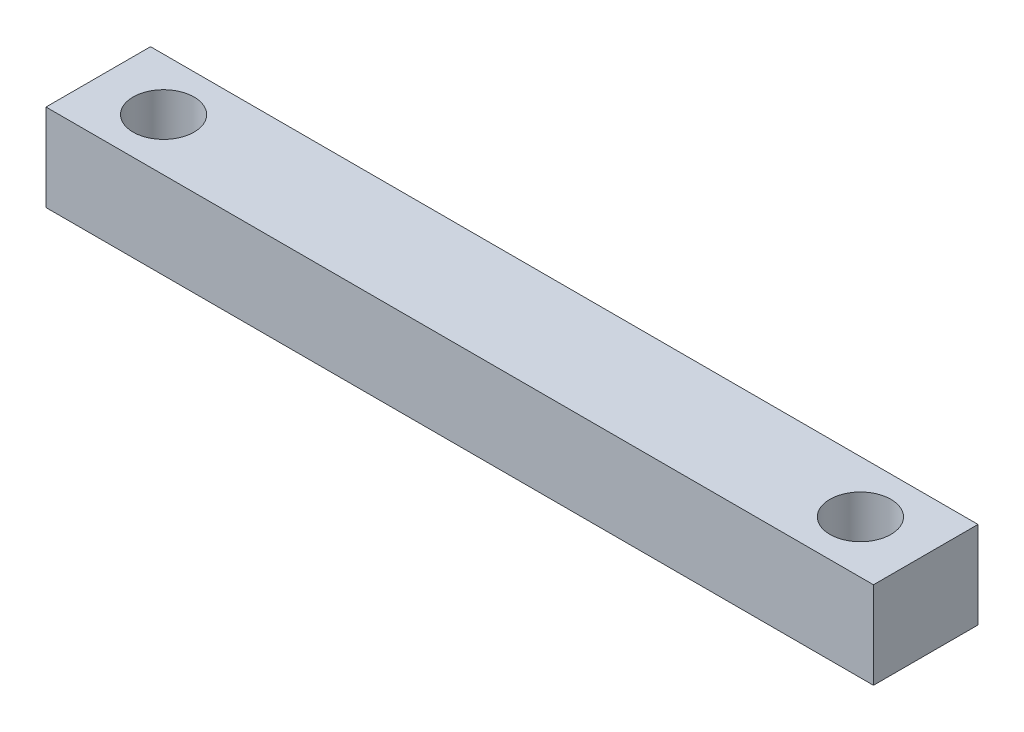
ISO-10303-21;
HEADER;
FILE_DESCRIPTION(('STEP AP214'),'2;1');
FILE_NAME('part.step','',(''),(''),'','','');
FILE_SCHEMA(('AUTOMOTIVE_DESIGN { 1 0 10303 214 1 1 1 1 }'));
ENDSEC;
DATA;
#1=APPLICATION_CONTEXT('core data for automotive mechanical design processes');
#2=APPLICATION_PROTOCOL_DEFINITION('international standard','automotive_design',2000,#1);
#3=PRODUCT_CONTEXT('',#1,'mechanical');
#4=PRODUCT('Part','Part','',(#3));
#5=PRODUCT_RELATED_PRODUCT_CATEGORY('part','',(#4));
#6=PRODUCT_DEFINITION_FORMATION('','',#4);
#7=PRODUCT_DEFINITION_CONTEXT('part definition',#1,'design');
#8=PRODUCT_DEFINITION('design','',#6,#7);
#9=PRODUCT_DEFINITION_SHAPE('','',#8);
#10=(LENGTH_UNIT() NAMED_UNIT(*) SI_UNIT(.MILLI.,.METRE.));
#11=(NAMED_UNIT(*) PLANE_ANGLE_UNIT() SI_UNIT($,.RADIAN.));
#12=(NAMED_UNIT(*) SI_UNIT($,.STERADIAN.) SOLID_ANGLE_UNIT());
#13=UNCERTAINTY_MEASURE_WITH_UNIT(LENGTH_MEASURE(1.E-05),#10,'distance_accuracy_value','');
#14=(GEOMETRIC_REPRESENTATION_CONTEXT(3) GLOBAL_UNCERTAINTY_ASSIGNED_CONTEXT((#13)) GLOBAL_UNIT_ASSIGNED_CONTEXT((#10,
#11,#12)) REPRESENTATION_CONTEXT('',''));
#15=CARTESIAN_POINT('',(0.,0.,0.));
#16=DIRECTION('',(0.,0.,1.));
#17=DIRECTION('',(1.,0.,0.));
#18=AXIS2_PLACEMENT_3D('',#15,#16,#17);
#19=CARTESIAN_POINT('',(0.,5.,0.));
#20=DIRECTION('',(0.,-1.,0.));
#21=DIRECTION('',(0.,0.,-1.));
#22=AXIS2_PLACEMENT_3D('',#19,#20,#21);
#23=PLANE('',#22);
#24=DIRECTION('',(0.,0.,-1.));
#25=VECTOR('',#24,1.);
#26=CARTESIAN_POINT('',(23.75,5.,3.));
#27=LINE('',#26,#25);
#28=CARTESIAN_POINT('',(23.75,5.,3.));
#29=VERTEX_POINT('',#28);
#30=CARTESIAN_POINT('',(23.75,5.,-3.));
#31=VERTEX_POINT('',#30);
#32=EDGE_CURVE('E96',#29,#31,#27,.T.);
#33=ORIENTED_EDGE('',*,*,#32,.T.);
#34=DIRECTION('',(-1.,0.,0.));
#35=VECTOR('',#34,1.);
#36=CARTESIAN_POINT('',(-23.75,5.,-3.));
#37=LINE('',#36,#35);
#38=CARTESIAN_POINT('',(-23.75,5.,-3.));
#39=VERTEX_POINT('',#38);
#40=EDGE_CURVE('E91',#31,#39,#37,.T.);
#41=ORIENTED_EDGE('',*,*,#40,.T.);
#42=DIRECTION('',(0.,0.,1.));
#43=VECTOR('',#42,1.);
#44=CARTESIAN_POINT('',(-23.75,5.,3.));
#45=LINE('',#44,#43);
#46=CARTESIAN_POINT('',(-23.75,5.,3.));
#47=VERTEX_POINT('',#46);
#48=EDGE_CURVE('E94',#39,#47,#45,.T.);
#49=ORIENTED_EDGE('',*,*,#48,.T.);
#50=DIRECTION('',(1.,0.,0.));
#51=VECTOR('',#50,1.);
#52=CARTESIAN_POINT('',(-23.75,5.,3.));
#53=LINE('',#52,#51);
#54=EDGE_CURVE('E61',#47,#29,#53,.T.);
#55=ORIENTED_EDGE('',*,*,#54,.T.);
#56=EDGE_LOOP('',(#33,#41,#49,#55));
#57=FACE_BOUND('',#56,.T.);
#58=CARTESIAN_POINT('',(-20.,5.,0.));
#59=DIRECTION('',(0.,1.,0.));
#60=DIRECTION('',(0.,0.,1.));
#61=AXIS2_PLACEMENT_3D('',#58,#59,#60);
#62=CIRCLE('',#61,1.75);
#63=CARTESIAN_POINT('',(-20.,5.,1.75));
#64=VERTEX_POINT('',#63);
#65=EDGE_CURVE('E116',#64,#64,#62,.T.);
#66=ORIENTED_EDGE('',*,*,#65,.F.);
#67=EDGE_LOOP('',(#66));
#68=FACE_BOUND('',#67,.T.);
#69=CARTESIAN_POINT('',(20.,5.,0.));
#70=DIRECTION('',(0.,1.,0.));
#71=DIRECTION('',(0.,0.,1.));
#72=AXIS2_PLACEMENT_3D('',#69,#70,#71);
#73=CIRCLE('',#72,1.75);
#74=CARTESIAN_POINT('',(20.,5.,1.75));
#75=VERTEX_POINT('',#74);
#76=EDGE_CURVE('E138',#75,#75,#73,.T.);
#77=ORIENTED_EDGE('',*,*,#76,.F.);
#78=EDGE_LOOP('',(#77));
#79=FACE_BOUND('',#78,.T.);
#80=ADVANCED_FACE('F43',(#57,#68,#79),#23,.F.);
#81=CARTESIAN_POINT('',(0.,0.,0.));
#82=DIRECTION('',(0.,-1.,0.));
#83=DIRECTION('',(0.,0.,-1.));
#84=AXIS2_PLACEMENT_3D('',#81,#82,#83);
#85=PLANE('',#84);
#86=CARTESIAN_POINT('',(-20.,0.,0.));
#87=DIRECTION('',(0.,1.,0.));
#88=DIRECTION('',(0.,0.,1.));
#89=AXIS2_PLACEMENT_3D('',#86,#87,#88);
#90=CIRCLE('',#89,1.75);
#91=CARTESIAN_POINT('',(-20.,0.,1.75));
#92=VERTEX_POINT('',#91);
#93=EDGE_CURVE('E134',#92,#92,#90,.T.);
#94=ORIENTED_EDGE('',*,*,#93,.T.);
#95=EDGE_LOOP('',(#94));
#96=FACE_BOUND('',#95,.T.);
#97=DIRECTION('',(0.,0.,-1.));
#98=VECTOR('',#97,1.);
#99=CARTESIAN_POINT('',(23.75,0.,3.));
#100=LINE('',#99,#98);
#101=CARTESIAN_POINT('',(23.75,0.,3.));
#102=VERTEX_POINT('',#101);
#103=CARTESIAN_POINT('',(23.75,0.,-3.));
#104=VERTEX_POINT('',#103);
#105=EDGE_CURVE('E112',#102,#104,#100,.T.);
#106=ORIENTED_EDGE('',*,*,#105,.F.);
#107=DIRECTION('',(1.,0.,0.));
#108=VECTOR('',#107,1.);
#109=CARTESIAN_POINT('',(-23.75,0.,3.));
#110=LINE('',#109,#108);
#111=CARTESIAN_POINT('',(-23.75,0.,3.));
#112=VERTEX_POINT('',#111);
#113=EDGE_CURVE('E84',#112,#102,#110,.T.);
#114=ORIENTED_EDGE('',*,*,#113,.F.);
#115=DIRECTION('',(0.,0.,1.));
#116=VECTOR('',#115,1.);
#117=CARTESIAN_POINT('',(-23.75,0.,3.));
#118=LINE('',#117,#116);
#119=CARTESIAN_POINT('',(-23.75,0.,-3.));
#120=VERTEX_POINT('',#119);
#121=EDGE_CURVE('E78',#120,#112,#118,.T.);
#122=ORIENTED_EDGE('',*,*,#121,.F.);
#123=DIRECTION('',(-1.,0.,0.));
#124=VECTOR('',#123,1.);
#125=CARTESIAN_POINT('',(-23.75,0.,-3.));
#126=LINE('',#125,#124);
#127=EDGE_CURVE('E101',#104,#120,#126,.T.);
#128=ORIENTED_EDGE('',*,*,#127,.F.);
#129=EDGE_LOOP('',(#106,#114,#122,#128));
#130=FACE_BOUND('',#129,.T.);
#131=CARTESIAN_POINT('',(20.,0.,0.));
#132=DIRECTION('',(0.,1.,0.));
#133=DIRECTION('',(0.,0.,1.));
#134=AXIS2_PLACEMENT_3D('',#131,#132,#133);
#135=CIRCLE('',#134,1.75);
#136=CARTESIAN_POINT('',(20.,0.,1.75));
#137=VERTEX_POINT('',#136);
#138=EDGE_CURVE('E142',#137,#137,#135,.T.);
#139=ORIENTED_EDGE('',*,*,#138,.T.);
#140=EDGE_LOOP('',(#139));
#141=FACE_BOUND('',#140,.T.);
#142=ADVANCED_FACE('F129',(#96,#130,#141),#85,.T.);
#143=CARTESIAN_POINT('',(23.75,5.,3.));
#144=DIRECTION('',(-1.,0.,0.));
#145=DIRECTION('',(0.,0.,1.));
#146=AXIS2_PLACEMENT_3D('',#143,#144,#145);
#147=PLANE('',#146);
#148=ORIENTED_EDGE('',*,*,#105,.T.);
#149=DIRECTION('',(0.,-1.,0.));
#150=VECTOR('',#149,1.);
#151=CARTESIAN_POINT('',(23.75,5.,-3.));
#152=LINE('',#151,#150);
#153=EDGE_CURVE('E11',#31,#104,#152,.T.);
#154=ORIENTED_EDGE('',*,*,#153,.F.);
#155=ORIENTED_EDGE('',*,*,#32,.F.);
#156=DIRECTION('',(0.,-1.,0.));
#157=VECTOR('',#156,1.);
#158=CARTESIAN_POINT('',(23.75,5.,3.));
#159=LINE('',#158,#157);
#160=EDGE_CURVE('E108',#29,#102,#159,.T.);
#161=ORIENTED_EDGE('',*,*,#160,.T.);
#162=EDGE_LOOP('',(#148,#154,#155,#161));
#163=FACE_BOUND('',#162,.T.);
#164=ADVANCED_FACE('F45',(#163),#147,.F.);
#165=CARTESIAN_POINT('',(-23.75,5.,-3.));
#166=DIRECTION('',(0.,0.,1.));
#167=DIRECTION('',(1.,0.,0.));
#168=AXIS2_PLACEMENT_3D('',#165,#166,#167);
#169=PLANE('',#168);
#170=ORIENTED_EDGE('',*,*,#127,.T.);
#171=DIRECTION('',(0.,-1.,0.));
#172=VECTOR('',#171,1.);
#173=CARTESIAN_POINT('',(-23.75,5.,-3.));
#174=LINE('',#173,#172);
#175=EDGE_CURVE('E53',#39,#120,#174,.T.);
#176=ORIENTED_EDGE('',*,*,#175,.F.);
#177=ORIENTED_EDGE('',*,*,#40,.F.);
#178=ORIENTED_EDGE('',*,*,#153,.T.);
#179=EDGE_LOOP('',(#170,#176,#177,#178));
#180=FACE_BOUND('',#179,.T.);
#181=ADVANCED_FACE('F100',(#180),#169,.F.);
#182=CARTESIAN_POINT('',(-23.75,5.,3.));
#183=DIRECTION('',(1.,0.,0.));
#184=DIRECTION('',(0.,0.,-1.));
#185=AXIS2_PLACEMENT_3D('',#182,#183,#184);
#186=PLANE('',#185);
#187=ORIENTED_EDGE('',*,*,#121,.T.);
#188=DIRECTION('',(0.,-1.,0.));
#189=VECTOR('',#188,1.);
#190=CARTESIAN_POINT('',(-23.75,5.,3.));
#191=LINE('',#190,#189);
#192=EDGE_CURVE('E103',#47,#112,#191,.T.);
#193=ORIENTED_EDGE('',*,*,#192,.F.);
#194=ORIENTED_EDGE('',*,*,#48,.F.);
#195=ORIENTED_EDGE('',*,*,#175,.T.);
#196=EDGE_LOOP('',(#187,#193,#194,#195));
#197=FACE_BOUND('',#196,.T.);
#198=ADVANCED_FACE('F104',(#197),#186,.F.);
#199=CARTESIAN_POINT('',(-23.75,5.,3.));
#200=DIRECTION('',(0.,0.,-1.));
#201=DIRECTION('',(-1.,0.,0.));
#202=AXIS2_PLACEMENT_3D('',#199,#200,#201);
#203=PLANE('',#202);
#204=ORIENTED_EDGE('',*,*,#113,.T.);
#205=ORIENTED_EDGE('',*,*,#160,.F.);
#206=ORIENTED_EDGE('',*,*,#54,.F.);
#207=ORIENTED_EDGE('',*,*,#192,.T.);
#208=EDGE_LOOP('',(#204,#205,#206,#207));
#209=FACE_BOUND('',#208,.T.);
#210=ADVANCED_FACE('F126',(#209),#203,.F.);
#211=CARTESIAN_POINT('',(-20.,5.,0.));
#212=DIRECTION('',(0.,-1.,0.));
#213=DIRECTION('',(0.,0.,-1.));
#214=AXIS2_PLACEMENT_3D('',#211,#212,#213);
#215=CYLINDRICAL_SURFACE('',#214,1.75);
#216=ORIENTED_EDGE('',*,*,#65,.T.);
#217=EDGE_LOOP('',(#216));
#218=FACE_BOUND('',#217,.T.);
#219=ORIENTED_EDGE('',*,*,#93,.F.);
#220=EDGE_LOOP('',(#219));
#221=FACE_BOUND('',#220,.T.);
#222=ADVANCED_FACE('F161',(#218,#221),#215,.F.);
#223=CARTESIAN_POINT('',(20.,5.,0.));
#224=DIRECTION('',(0.,-1.,0.));
#225=DIRECTION('',(0.,0.,-1.));
#226=AXIS2_PLACEMENT_3D('',#223,#224,#225);
#227=CYLINDRICAL_SURFACE('',#226,1.75);
#228=ORIENTED_EDGE('',*,*,#76,.T.);
#229=EDGE_LOOP('',(#228));
#230=FACE_BOUND('',#229,.T.);
#231=ORIENTED_EDGE('',*,*,#138,.F.);
#232=EDGE_LOOP('',(#231));
#233=FACE_BOUND('',#232,.T.);
#234=ADVANCED_FACE('F150',(#230,#233),#227,.F.);
#235=CLOSED_SHELL('',(#80,#142,#164,#181,#198,#210,#222,#234));
#236=MANIFOLD_SOLID_BREP('B2',#235);
#237=ADVANCED_BREP_SHAPE_REPRESENTATION('',(#18,#236),#14);
#238=SHAPE_DEFINITION_REPRESENTATION(#9,#237);
ENDSEC;
END-ISO-10303-21;
